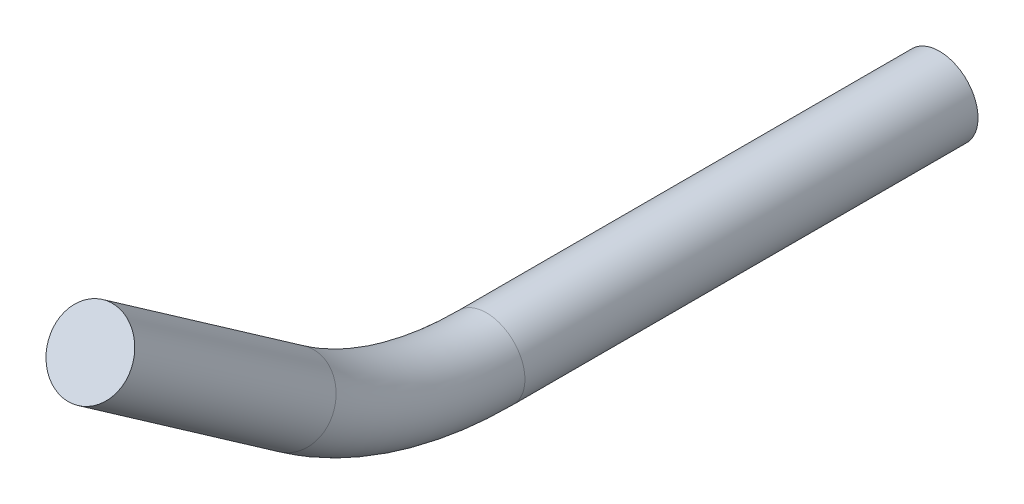
ISO-10303-21;
HEADER;
FILE_DESCRIPTION(('STEP AP214'),'2;1');
FILE_NAME('part.step','',(''),(''),'','','');
FILE_SCHEMA(('AUTOMOTIVE_DESIGN { 1 0 10303 214 1 1 1 1 }'));
ENDSEC;
DATA;
#1=APPLICATION_CONTEXT('core data for automotive mechanical design processes');
#2=APPLICATION_PROTOCOL_DEFINITION('international standard','automotive_design',2000,#1);
#3=PRODUCT_CONTEXT('',#1,'mechanical');
#4=PRODUCT('Part','Part','',(#3));
#5=PRODUCT_RELATED_PRODUCT_CATEGORY('part','',(#4));
#6=PRODUCT_DEFINITION_FORMATION('','',#4);
#7=PRODUCT_DEFINITION_CONTEXT('part definition',#1,'design');
#8=PRODUCT_DEFINITION('design','',#6,#7);
#9=PRODUCT_DEFINITION_SHAPE('','',#8);
#10=(LENGTH_UNIT() NAMED_UNIT(*) SI_UNIT(.MILLI.,.METRE.));
#11=(NAMED_UNIT(*) PLANE_ANGLE_UNIT() SI_UNIT($,.RADIAN.));
#12=(NAMED_UNIT(*) SI_UNIT($,.STERADIAN.) SOLID_ANGLE_UNIT());
#13=UNCERTAINTY_MEASURE_WITH_UNIT(LENGTH_MEASURE(1.E-05),#10,'distance_accuracy_value','');
#14=(GEOMETRIC_REPRESENTATION_CONTEXT(3) GLOBAL_UNCERTAINTY_ASSIGNED_CONTEXT((#13)) GLOBAL_UNIT_ASSIGNED_CONTEXT((#10,
#11,#12)) REPRESENTATION_CONTEXT('',''));
#15=CARTESIAN_POINT('',(0.,0.,0.));
#16=DIRECTION('',(0.,0.,1.));
#17=DIRECTION('',(1.,0.,0.));
#18=AXIS2_PLACEMENT_3D('',#15,#16,#17);
#19=CARTESIAN_POINT('',(0.,0.,0.));
#20=DIRECTION('',(0.,0.,1.));
#21=DIRECTION('',(1.,0.,0.));
#22=AXIS2_PLACEMENT_3D('',#19,#20,#21);
#23=CYLINDRICAL_SURFACE('',#22,8.5);
#24=CARTESIAN_POINT('',(0.,0.,-100.));
#25=DIRECTION('',(0.,0.,1.));
#26=DIRECTION('',(1.,0.,0.));
#27=AXIS2_PLACEMENT_3D('',#24,#25,#26);
#28=CIRCLE('',#27,8.5);
#29=CARTESIAN_POINT('',(8.5,0.,-100.));
#30=VERTEX_POINT('',#29);
#31=EDGE_CURVE('E73',#30,#30,#28,.T.);
#32=ORIENTED_EDGE('',*,*,#31,.F.);
#33=EDGE_LOOP('',(#32));
#34=FACE_BOUND('',#33,.T.);
#35=CARTESIAN_POINT('',(0.,0.,-200.));
#36=DIRECTION('',(0.,0.,1.));
#37=DIRECTION('',(1.,0.,0.));
#38=AXIS2_PLACEMENT_3D('',#35,#36,#37);
#39=CIRCLE('',#38,8.5);
#40=CARTESIAN_POINT('',(8.5,0.,-200.));
#41=VERTEX_POINT('',#40);
#42=EDGE_CURVE('E12',#41,#41,#39,.T.);
#43=ORIENTED_EDGE('',*,*,#42,.T.);
#44=EDGE_LOOP('',(#43));
#45=FACE_BOUND('',#44,.T.);
#46=ADVANCED_FACE('F65',(#34,#45),#23,.T.);
#47=CARTESIAN_POINT('',(-5.2372220082647E-13,75.,-100.));
#48=DIRECTION('',(-1.,0.,0.));
#49=DIRECTION('',(0.,-1.,0.));
#50=AXIS2_PLACEMENT_3D('',#47,#48,#49);
#51=TOROIDAL_SURFACE('',#50,75.,8.5);
#52=CARTESIAN_POINT('',(0.,13.5355659397471,-57.0218271019717));
#53=DIRECTION('',(0.,0.573042305307045,0.819525787470039));
#54=DIRECTION('',(1.,0.,0.));
#55=AXIS2_PLACEMENT_3D('',#52,#53,#54);
#56=CIRCLE('',#55,8.5);
#57=CARTESIAN_POINT('',(8.49999999999991,13.5355659397471,-57.0218271019716));
#58=VERTEX_POINT('',#57);
#59=EDGE_CURVE('E77',#58,#58,#56,.T.);
#60=ORIENTED_EDGE('',*,*,#59,.F.);
#61=EDGE_LOOP('',(#60));
#62=FACE_BOUND('',#61,.T.);
#63=ORIENTED_EDGE('',*,*,#31,.T.);
#64=EDGE_LOOP('',(#63));
#65=FACE_BOUND('',#64,.T.);
#66=ADVANCED_FACE('F94',(#62,#65),#51,.T.);
#67=CARTESIAN_POINT('',(-3.11537494165295E-13,44.6139423257693,-12.5756655443216));
#68=DIRECTION('',(0.,0.573042305307045,0.819525787470039));
#69=DIRECTION('',(1.,0.,0.));
#70=AXIS2_PLACEMENT_3D('',#67,#68,#69);
#71=CYLINDRICAL_SURFACE('',#70,8.5);
#72=CARTESIAN_POINT('',(-3.11537494165295E-13,44.6139423257693,-12.5756655443216));
#73=DIRECTION('',(0.,0.573042305307045,0.819525787470039));
#74=DIRECTION('',(1.,0.,0.));
#75=AXIS2_PLACEMENT_3D('',#72,#73,#74);
#76=CIRCLE('',#75,8.5);
#77=CARTESIAN_POINT('',(8.49999999999969,44.6139423257693,-12.5756655443215));
#78=VERTEX_POINT('',#77);
#79=EDGE_CURVE('E82',#78,#78,#76,.T.);
#80=ORIENTED_EDGE('',*,*,#79,.F.);
#81=EDGE_LOOP('',(#80));
#82=FACE_BOUND('',#81,.T.);
#83=ORIENTED_EDGE('',*,*,#59,.T.);
#84=EDGE_LOOP('',(#83));
#85=FACE_BOUND('',#84,.T.);
#86=ADVANCED_FACE('F92',(#82,#85),#71,.T.);
#87=CARTESIAN_POINT('',(-3.11537494165295E-13,44.6139423257693,-12.5756655443216));
#88=DIRECTION('',(0.,-0.573042305307045,-0.819525787470039));
#89=DIRECTION('',(-1.,0.,0.));
#90=AXIS2_PLACEMENT_3D('',#87,#88,#89);
#91=PLANE('',#90);
#92=ORIENTED_EDGE('',*,*,#79,.T.);
#93=EDGE_LOOP('',(#92));
#94=FACE_BOUND('',#93,.T.);
#95=ADVANCED_FACE('F106',(#94),#91,.F.);
#96=CARTESIAN_POINT('',(0.,0.,-200.));
#97=DIRECTION('',(0.,0.,1.));
#98=DIRECTION('',(1.,0.,0.));
#99=AXIS2_PLACEMENT_3D('',#96,#97,#98);
#100=PLANE('',#99);
#101=ORIENTED_EDGE('',*,*,#42,.F.);
#102=EDGE_LOOP('',(#101));
#103=FACE_BOUND('',#102,.T.);
#104=ADVANCED_FACE('F67',(#103),#100,.F.);
#105=CLOSED_SHELL('',(#46,#66,#86,#95,#104));
#106=MANIFOLD_SOLID_BREP('B2',#105);
#107=ADVANCED_BREP_SHAPE_REPRESENTATION('',(#18,#106),#14);
#108=SHAPE_DEFINITION_REPRESENTATION(#9,#107);
ENDSEC;
END-ISO-10303-21;
